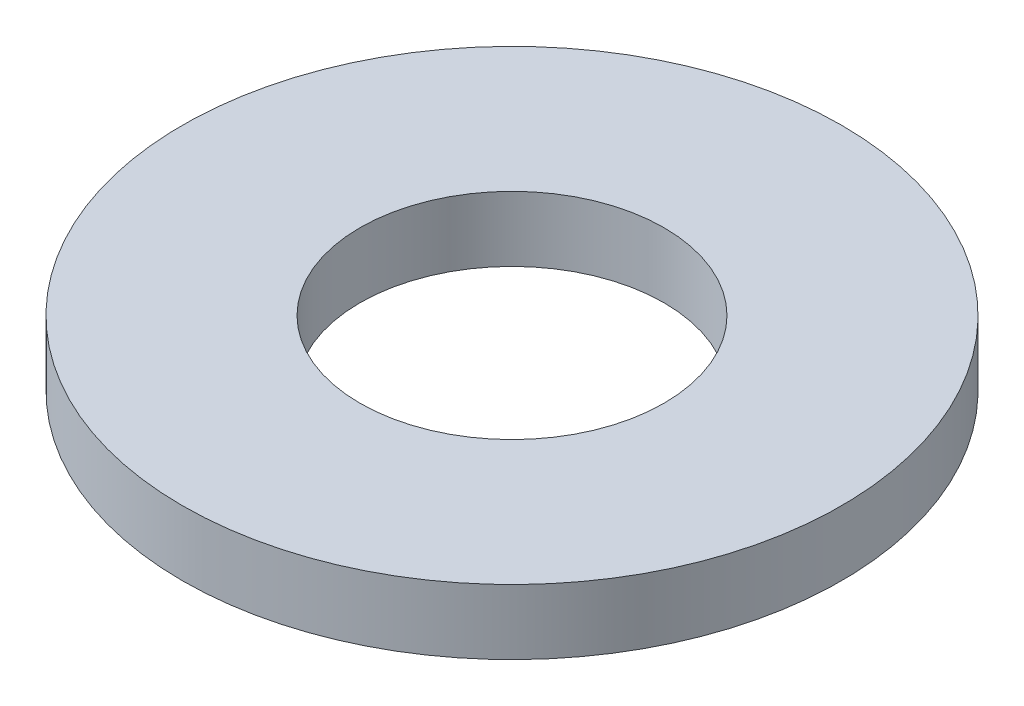
ISO-10303-21;
HEADER;
FILE_DESCRIPTION(('STEP AP214'),'2;1');
FILE_NAME('part.step','',(''),(''),'','','');
FILE_SCHEMA(('AUTOMOTIVE_DESIGN { 1 0 10303 214 1 1 1 1 }'));
ENDSEC;
DATA;
#1=APPLICATION_CONTEXT('core data for automotive mechanical design processes');
#2=APPLICATION_PROTOCOL_DEFINITION('international standard','automotive_design',2000,#1);
#3=PRODUCT_CONTEXT('',#1,'mechanical');
#4=PRODUCT('Part','Part','',(#3));
#5=PRODUCT_RELATED_PRODUCT_CATEGORY('part','',(#4));
#6=PRODUCT_DEFINITION_FORMATION('','',#4);
#7=PRODUCT_DEFINITION_CONTEXT('part definition',#1,'design');
#8=PRODUCT_DEFINITION('design','',#6,#7);
#9=PRODUCT_DEFINITION_SHAPE('','',#8);
#10=(LENGTH_UNIT() NAMED_UNIT(*) SI_UNIT(.MILLI.,.METRE.));
#11=(NAMED_UNIT(*) PLANE_ANGLE_UNIT() SI_UNIT($,.RADIAN.));
#12=(NAMED_UNIT(*) SI_UNIT($,.STERADIAN.) SOLID_ANGLE_UNIT());
#13=UNCERTAINTY_MEASURE_WITH_UNIT(LENGTH_MEASURE(1.E-05),#10,'distance_accuracy_value','');
#14=(GEOMETRIC_REPRESENTATION_CONTEXT(3) GLOBAL_UNCERTAINTY_ASSIGNED_CONTEXT((#13)) GLOBAL_UNIT_ASSIGNED_CONTEXT((#10,
#11,#12)) REPRESENTATION_CONTEXT('',''));
#15=CARTESIAN_POINT('',(0.,0.,0.));
#16=DIRECTION('',(0.,0.,1.));
#17=DIRECTION('',(1.,0.,0.));
#18=AXIS2_PLACEMENT_3D('',#15,#16,#17);
#19=CARTESIAN_POINT('',(0.,0.9398,0.));
#20=DIRECTION('',(0.,1.,0.));
#21=DIRECTION('',(0.,0.,1.));
#22=AXIS2_PLACEMENT_3D('',#19,#20,#21);
#23=PLANE('',#22);
#24=CARTESIAN_POINT('',(0.,0.9398,0.));
#25=DIRECTION('',(0.,-1.,0.));
#26=DIRECTION('',(0.,0.,-1.));
#27=AXIS2_PLACEMENT_3D('',#24,#25,#26);
#28=CIRCLE('',#27,2.1971);
#29=CARTESIAN_POINT('',(0.,0.9398,-2.1971));
#30=VERTEX_POINT('',#29);
#31=EDGE_CURVE('E26',#30,#30,#28,.T.);
#32=ORIENTED_EDGE('',*,*,#31,.T.);
#33=EDGE_LOOP('',(#32));
#34=FACE_BOUND('',#33,.T.);
#35=CARTESIAN_POINT('',(0.,0.9398,0.));
#36=DIRECTION('',(0.,-1.,0.));
#37=DIRECTION('',(0.,0.,-1.));
#38=AXIS2_PLACEMENT_3D('',#35,#36,#37);
#39=CIRCLE('',#38,4.7625);
#40=CARTESIAN_POINT('',(0.,0.9398,-4.7625));
#41=VERTEX_POINT('',#40);
#42=EDGE_CURVE('E17',#41,#41,#39,.T.);
#43=ORIENTED_EDGE('',*,*,#42,.F.);
#44=EDGE_LOOP('',(#43));
#45=FACE_BOUND('',#44,.T.);
#46=ADVANCED_FACE('F14',(#34,#45),#23,.T.);
#47=CARTESIAN_POINT('',(0.,0.9398,0.));
#48=DIRECTION('',(0.,-1.,0.));
#49=DIRECTION('',(0.,0.,-1.));
#50=AXIS2_PLACEMENT_3D('',#47,#48,#49);
#51=CYLINDRICAL_SURFACE('',#50,4.7625);
#52=ORIENTED_EDGE('',*,*,#42,.T.);
#53=EDGE_LOOP('',(#52));
#54=FACE_BOUND('',#53,.T.);
#55=CARTESIAN_POINT('',(0.,0.,0.));
#56=DIRECTION('',(0.,-1.,0.));
#57=DIRECTION('',(0.,0.,-1.));
#58=AXIS2_PLACEMENT_3D('',#55,#56,#57);
#59=CIRCLE('',#58,4.7625);
#60=CARTESIAN_POINT('',(0.,0.,-4.7625));
#61=VERTEX_POINT('',#60);
#62=EDGE_CURVE('E21',#61,#61,#59,.F.);
#63=ORIENTED_EDGE('',*,*,#62,.T.);
#64=EDGE_LOOP('',(#63));
#65=FACE_BOUND('',#64,.T.);
#66=ADVANCED_FACE('F34',(#54,#65),#51,.T.);
#67=CARTESIAN_POINT('',(0.,0.9398,0.));
#68=DIRECTION('',(0.,-1.,0.));
#69=DIRECTION('',(0.,0.,-1.));
#70=AXIS2_PLACEMENT_3D('',#67,#68,#69);
#71=CYLINDRICAL_SURFACE('',#70,2.1971);
#72=CARTESIAN_POINT('',(0.,0.,0.));
#73=DIRECTION('',(0.,-1.,0.));
#74=DIRECTION('',(0.,0.,-1.));
#75=AXIS2_PLACEMENT_3D('',#72,#73,#74);
#76=CIRCLE('',#75,2.1971);
#77=CARTESIAN_POINT('',(0.,0.,-2.1971));
#78=VERTEX_POINT('',#77);
#79=EDGE_CURVE('E9',#78,#78,#76,.T.);
#80=ORIENTED_EDGE('',*,*,#79,.T.);
#81=EDGE_LOOP('',(#80));
#82=FACE_BOUND('',#81,.T.);
#83=ORIENTED_EDGE('',*,*,#31,.F.);
#84=EDGE_LOOP('',(#83));
#85=FACE_BOUND('',#84,.T.);
#86=ADVANCED_FACE('F42',(#82,#85),#71,.F.);
#87=CARTESIAN_POINT('',(0.,0.,0.));
#88=DIRECTION('',(0.,1.,0.));
#89=DIRECTION('',(0.,0.,1.));
#90=AXIS2_PLACEMENT_3D('',#87,#88,#89);
#91=PLANE('',#90);
#92=ORIENTED_EDGE('',*,*,#79,.F.);
#93=EDGE_LOOP('',(#92));
#94=FACE_BOUND('',#93,.T.);
#95=ORIENTED_EDGE('',*,*,#62,.F.);
#96=EDGE_LOOP('',(#95));
#97=FACE_BOUND('',#96,.T.);
#98=ADVANCED_FACE('F43',(#94,#97),#91,.F.);
#99=CLOSED_SHELL('',(#46,#66,#86,#98));
#100=MANIFOLD_SOLID_BREP('B1',#99);
#101=ADVANCED_BREP_SHAPE_REPRESENTATION('',(#18,#100),#14);
#102=SHAPE_DEFINITION_REPRESENTATION(#9,#101);
ENDSEC;
END-ISO-10303-21;
